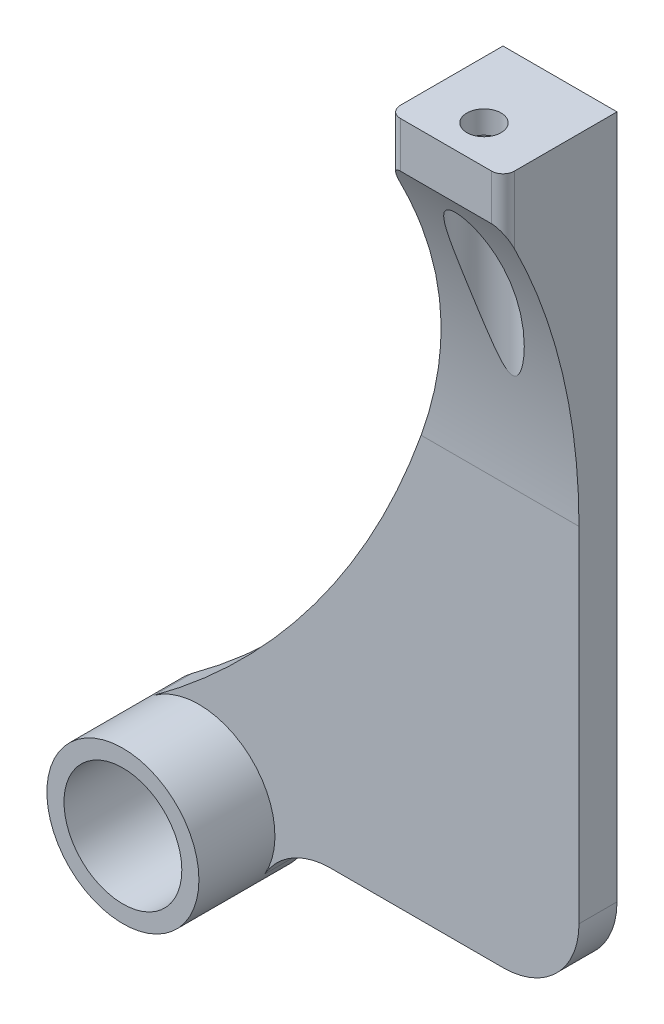
ISO-10303-21;
HEADER;
FILE_DESCRIPTION(('STEP AP214'),'2;1');
FILE_NAME('part.step','',(''),(''),'','','');
FILE_SCHEMA(('AUTOMOTIVE_DESIGN { 1 0 10303 214 1 1 1 1 }'));
ENDSEC;
DATA;
#1=APPLICATION_CONTEXT('core data for automotive mechanical design processes');
#2=APPLICATION_PROTOCOL_DEFINITION('international standard','automotive_design',2000,#1);
#3=PRODUCT_CONTEXT('',#1,'mechanical');
#4=PRODUCT('Part','Part','',(#3));
#5=PRODUCT_RELATED_PRODUCT_CATEGORY('part','',(#4));
#6=PRODUCT_DEFINITION_FORMATION('','',#4);
#7=PRODUCT_DEFINITION_CONTEXT('part definition',#1,'design');
#8=PRODUCT_DEFINITION('design','',#6,#7);
#9=PRODUCT_DEFINITION_SHAPE('','',#8);
#10=(LENGTH_UNIT() NAMED_UNIT(*) SI_UNIT(.MILLI.,.METRE.));
#11=(NAMED_UNIT(*) PLANE_ANGLE_UNIT() SI_UNIT($,.RADIAN.));
#12=(NAMED_UNIT(*) SI_UNIT($,.STERADIAN.) SOLID_ANGLE_UNIT());
#13=UNCERTAINTY_MEASURE_WITH_UNIT(LENGTH_MEASURE(1.E-05),#10,'distance_accuracy_value','');
#14=(GEOMETRIC_REPRESENTATION_CONTEXT(3) GLOBAL_UNCERTAINTY_ASSIGNED_CONTEXT((#13)) GLOBAL_UNIT_ASSIGNED_CONTEXT((#10,
#11,#12)) REPRESENTATION_CONTEXT('',''));
#15=CARTESIAN_POINT('',(0.,0.,0.));
#16=DIRECTION('',(0.,0.,1.));
#17=DIRECTION('',(1.,0.,0.));
#18=AXIS2_PLACEMENT_3D('',#15,#16,#17);
#19=CARTESIAN_POINT('',(-32.5,-50.,15.));
#20=DIRECTION('',(0.,1.,0.));
#21=DIRECTION('',(0.,0.,1.));
#22=AXIS2_PLACEMENT_3D('',#19,#20,#21);
#23=PLANE('',#22);
#24=DIRECTION('',(1.,0.,0.));
#25=VECTOR('',#24,1.);
#26=CARTESIAN_POINT('',(-25.1794919243112,-50.,5.));
#27=LINE('',#26,#25);
#28=CARTESIAN_POINT('',(-25.1794919243112,-50.,5.));
#29=VERTEX_POINT('',#28);
#30=CARTESIAN_POINT('',(-2.5,-50.,5.));
#31=VERTEX_POINT('',#30);
#32=EDGE_CURVE('E231',#29,#31,#27,.T.);
#33=ORIENTED_EDGE('',*,*,#32,.F.);
#34=DIRECTION('',(0.,0.,1.));
#35=VECTOR('',#34,1.);
#36=CARTESIAN_POINT('',(-25.1794919243112,-50.,0.));
#37=LINE('',#36,#35);
#38=CARTESIAN_POINT('',(-25.1794919243112,-50.,0.));
#39=VERTEX_POINT('',#38);
#40=EDGE_CURVE('E261',#29,#39,#37,.F.);
#41=ORIENTED_EDGE('',*,*,#40,.T.);
#42=DIRECTION('',(1.,0.,0.));
#43=VECTOR('',#42,1.);
#44=CARTESIAN_POINT('',(-32.5,-50.,0.));
#45=LINE('',#44,#43);
#46=CARTESIAN_POINT('',(-2.5,-50.,0.));
#47=VERTEX_POINT('',#46);
#48=EDGE_CURVE('E250',#39,#47,#45,.T.);
#49=ORIENTED_EDGE('',*,*,#48,.T.);
#50=DIRECTION('',(0.,0.,-1.));
#51=VECTOR('',#50,1.);
#52=CARTESIAN_POINT('',(-2.5,-50.,15.));
#53=LINE('',#52,#51);
#54=EDGE_CURVE('E263',#47,#31,#53,.F.);
#55=ORIENTED_EDGE('',*,*,#54,.T.);
#56=EDGE_LOOP('',(#33,#41,#49,#55));
#57=FACE_BOUND('',#56,.T.);
#58=ADVANCED_FACE('F39',(#57),#23,.F.);
#59=CARTESIAN_POINT('',(-42.5,-50.,15.));
#60=DIRECTION('',(0.,0.,1.));
#61=DIRECTION('',(1.,0.,0.));
#62=AXIS2_PLACEMENT_3D('',#59,#60,#61);
#63=PLANE('',#62);
#64=DIRECTION('',(1.,0.,0.));
#65=VECTOR('',#64,1.);
#66=CARTESIAN_POINT('',(-7.5,50.,15.));
#67=LINE('',#66,#65);
#68=CARTESIAN_POINT('',(-6.,50.,15.));
#69=VERTEX_POINT('',#68);
#70=CARTESIAN_POINT('',(6.,50.,15.));
#71=VERTEX_POINT('',#70);
#72=EDGE_CURVE('E237',#69,#71,#67,.T.);
#73=ORIENTED_EDGE('',*,*,#72,.F.);
#74=DIRECTION('',(0.,1.,0.));
#75=VECTOR('',#74,1.);
#76=CARTESIAN_POINT('',(-6.,-50.,15.));
#77=LINE('',#76,#75);
#78=CARTESIAN_POINT('',(-6.,44.,15.));
#79=VERTEX_POINT('',#78);
#80=EDGE_CURVE('E177',#69,#79,#77,.F.);
#81=ORIENTED_EDGE('',*,*,#80,.T.);
#82=DIRECTION('',(-1.,0.,0.));
#83=VECTOR('',#82,1.);
#84=CARTESIAN_POINT('',(-7.5,44.,15.));
#85=LINE('',#84,#83);
#86=CARTESIAN_POINT('',(6.,44.,15.));
#87=VERTEX_POINT('',#86);
#88=EDGE_CURVE('E145',#87,#79,#85,.T.);
#89=ORIENTED_EDGE('',*,*,#88,.F.);
#90=DIRECTION('',(0.,1.,0.));
#91=VECTOR('',#90,1.);
#92=CARTESIAN_POINT('',(6.,50.,15.));
#93=LINE('',#92,#91);
#94=EDGE_CURVE('E174',#87,#71,#93,.T.);
#95=ORIENTED_EDGE('',*,*,#94,.T.);
#96=EDGE_LOOP('',(#73,#81,#89,#95));
#97=FACE_BOUND('',#96,.T.);
#98=ADVANCED_FACE('F283',(#97),#63,.T.);
#99=CARTESIAN_POINT('',(-42.5,-50.,15.));
#100=DIRECTION('',(0.,0.,1.));
#101=DIRECTION('',(1.,0.,0.));
#102=AXIS2_PLACEMENT_3D('',#99,#100,#101);
#103=CIRCLE('',#102,7.75);
#104=CARTESIAN_POINT('',(-34.75,-50.,15.));
#105=VERTEX_POINT('',#104);
#106=EDGE_CURVE('E350',#105,#105,#103,.T.);
#107=ORIENTED_EDGE('',*,*,#106,.F.);
#108=EDGE_LOOP('',(#107));
#109=FACE_BOUND('',#108,.T.);
#110=CARTESIAN_POINT('',(-42.5,-50.,15.));
#111=DIRECTION('',(0.,0.,1.));
#112=DIRECTION('',(1.,0.,0.));
#113=AXIS2_PLACEMENT_3D('',#110,#111,#112);
#114=CIRCLE('',#113,10.);
#115=CARTESIAN_POINT('',(-32.5,-50.,15.));
#116=VERTEX_POINT('',#115);
#117=EDGE_CURVE('E240',#116,#116,#114,.T.);
#118=ORIENTED_EDGE('',*,*,#117,.T.);
#119=EDGE_LOOP('',(#118));
#120=FACE_BOUND('',#119,.T.);
#121=ADVANCED_FACE('F303',(#109,#120),#63,.T.);
#122=CARTESIAN_POINT('',(-2.5,-40.,15.));
#123=DIRECTION('',(0.,0.,-1.));
#124=DIRECTION('',(-1.,0.,0.));
#125=AXIS2_PLACEMENT_3D('',#122,#123,#124);
#126=CYLINDRICAL_SURFACE('',#125,10.);
#127=DIRECTION('',(0.,0.,-1.));
#128=VECTOR('',#127,1.);
#129=CARTESIAN_POINT('',(7.5,-40.,15.));
#130=LINE('',#129,#128);
#131=CARTESIAN_POINT('',(7.5,-40.,5.));
#132=VERTEX_POINT('',#131);
#133=CARTESIAN_POINT('',(7.5,-40.,0.));
#134=VERTEX_POINT('',#133);
#135=EDGE_CURVE('E256',#132,#134,#130,.T.);
#136=ORIENTED_EDGE('',*,*,#135,.F.);
#137=CARTESIAN_POINT('',(-2.5,-40.,5.));
#138=DIRECTION('',(0.,0.,1.));
#139=DIRECTION('',(1.,0.,0.));
#140=AXIS2_PLACEMENT_3D('',#137,#138,#139);
#141=CIRCLE('',#140,10.);
#142=EDGE_CURVE('E225',#31,#132,#141,.T.);
#143=ORIENTED_EDGE('',*,*,#142,.F.);
#144=ORIENTED_EDGE('',*,*,#54,.F.);
#145=CARTESIAN_POINT('',(-2.5,-40.,0.));
#146=DIRECTION('',(0.,0.,1.));
#147=DIRECTION('',(1.,0.,0.));
#148=AXIS2_PLACEMENT_3D('',#145,#146,#147);
#149=CIRCLE('',#148,10.);
#150=EDGE_CURVE('E259',#134,#47,#149,.F.);
#151=ORIENTED_EDGE('',*,*,#150,.F.);
#152=EDGE_LOOP('',(#136,#143,#144,#151));
#153=FACE_BOUND('',#152,.T.);
#154=ADVANCED_FACE('F272',(#153),#126,.T.);
#155=CARTESIAN_POINT('',(-25.1794919243112,-60.,15.));
#156=DIRECTION('',(0.,0.,-1.));
#157=DIRECTION('',(-1.,0.,0.));
#158=AXIS2_PLACEMENT_3D('',#155,#156,#157);
#159=CYLINDRICAL_SURFACE('',#158,10.);
#160=CARTESIAN_POINT('',(-25.1794919243112,-60.,5.));
#161=DIRECTION('',(0.,0.,-1.));
#162=DIRECTION('',(1.,0.,0.));
#163=AXIS2_PLACEMENT_3D('',#160,#161,#162);
#164=CIRCLE('',#163,10.);
#165=CARTESIAN_POINT('',(-33.8397459621556,-55.,5.));
#166=VERTEX_POINT('',#165);
#167=EDGE_CURVE('E154',#166,#29,#164,.T.);
#168=ORIENTED_EDGE('',*,*,#167,.F.);
#169=DIRECTION('',(0.,0.,-1.));
#170=VECTOR('',#169,1.);
#171=CARTESIAN_POINT('',(-33.8397459621556,-55.,15.));
#172=LINE('',#171,#170);
#173=CARTESIAN_POINT('',(-33.8397459621556,-55.,0.));
#174=VERTEX_POINT('',#173);
#175=EDGE_CURVE('E153',#174,#166,#172,.F.);
#176=ORIENTED_EDGE('',*,*,#175,.F.);
#177=CARTESIAN_POINT('',(-25.1794919243112,-60.,0.));
#178=DIRECTION('',(0.,0.,1.));
#179=DIRECTION('',(1.,0.,0.));
#180=AXIS2_PLACEMENT_3D('',#177,#178,#179);
#181=CIRCLE('',#180,10.);
#182=EDGE_CURVE('E161',#39,#174,#181,.T.);
#183=ORIENTED_EDGE('',*,*,#182,.F.);
#184=ORIENTED_EDGE('',*,*,#40,.F.);
#185=EDGE_LOOP('',(#168,#176,#183,#184));
#186=FACE_BOUND('',#185,.T.);
#187=ADVANCED_FACE('F195',(#186),#159,.F.);
#188=CARTESIAN_POINT('',(-107.5,38.7411967464943,15.));
#189=DIRECTION('',(0.,0.,-1.));
#190=DIRECTION('',(-1.,0.,0.));
#191=AXIS2_PLACEMENT_3D('',#188,#189,#190);
#192=CYLINDRICAL_SURFACE('',#191,100.);
#193=CARTESIAN_POINT('',(-107.5,38.7411967464943,5.));
#194=DIRECTION('',(0.,0.,-1.));
#195=DIRECTION('',(1.,0.,0.));
#196=AXIS2_PLACEMENT_3D('',#193,#194,#195);
#197=CIRCLE('',#196,100.);
#198=CARTESIAN_POINT('',(-13.2678922193868,5.27016653792584,5.));
#199=VERTEX_POINT('',#198);
#200=CARTESIAN_POINT('',(-48.409090909091,-41.9326184775915,5.));
#201=VERTEX_POINT('',#200);
#202=EDGE_CURVE('E134',#199,#201,#197,.T.);
#203=ORIENTED_EDGE('',*,*,#202,.F.);
#204=CARTESIAN_POINT('',(-13.2678922193868,5.27016653792584,5.));
#205=CARTESIAN_POINT('',(-12.9601483993061,6.13650162935288,4.99998081129785));
#206=CARTESIAN_POINT('',(-12.6643852790211,7.00711687347346,5.01407204240441));
#207=CARTESIAN_POINT('',(-12.0972075129909,8.75535744566515,5.0711717880983));
#208=CARTESIAN_POINT('',(-11.8257943491233,9.6329831968434,5.11418206127511));
#209=CARTESIAN_POINT('',(-11.3076411514151,11.3939284760898,5.22983881612321));
#210=CARTESIAN_POINT('',(-11.0609106785094,12.2772500705213,5.30249672699747));
#211=CARTESIAN_POINT('',(-10.5925178092302,14.0475116901373,5.47799501129461));
#212=CARTESIAN_POINT('',(-10.3708546831186,14.9344516092093,5.58083450578482));
#213=CARTESIAN_POINT('',(-9.95749111681641,16.6900365864316,5.81444042111758));
#214=CARTESIAN_POINT('',(-9.76522467771554,17.5586398329573,5.94451979925321));
#215=CARTESIAN_POINT('',(-9.40479890683767,19.2959265322389,6.23418529288521));
#216=CARTESIAN_POINT('',(-9.23663948002106,20.164609984665,6.39377129204886));
#217=CARTESIAN_POINT('',(-8.92438957078949,21.8999982022366,6.74252965994711));
#218=CARTESIAN_POINT('',(-8.78028960873859,22.7667036133539,6.93169031885455));
#219=CARTESIAN_POINT('',(-8.51586294264522,24.4966775859483,7.33964264608898));
#220=CARTESIAN_POINT('',(-8.39553453512546,25.3599463893467,7.55843218930531));
#221=CARTESIAN_POINT('',(-8.15318384294389,27.2803677110144,8.07954536859807));
#222=CARTESIAN_POINT('',(-8.03719485756907,28.3362282546396,8.38948933262638));
#223=CARTESIAN_POINT('',(-7.83981116216768,30.4369891928573,9.05367252119334));
#224=CARTESIAN_POINT('',(-7.75841177302028,31.4818910512266,9.40790574608929));
#225=CARTESIAN_POINT('',(-7.62807670595758,33.5728625070728,10.1654403561484));
#226=CARTESIAN_POINT('',(-7.57962234847821,34.6187347646058,10.5693714756851));
#227=CARTESIAN_POINT('',(-7.53159213303704,36.1746967807895,11.208234839552));
#228=CARTESIAN_POINT('',(-7.51969065186097,36.6912539854283,11.4267041274613));
#229=CARTESIAN_POINT('',(-7.5038942343988,37.7197557383955,11.8745001565184));
#230=CARTESIAN_POINT('',(-7.49999918064137,38.2317003542908,12.1038267383161));
#231=CARTESIAN_POINT('',(-7.49999999999995,38.7411967464943,12.338523709072));
#232=B_SPLINE_CURVE_WITH_KNOTS('',3,(#204,#205,#206,#207,#208,#209,#210,#211,#212,#213,#214,
#215,#216,#217,#218,#219,#220,#221,#222,#223,#224,#225,#226,#227,#228,#229,#230,#231),
.UNSPECIFIED.,.F.,.F.,(4,2,2,2,2,2,2,2,2,2,2,2,2,4),(0.,2.75795055143389,5.51606883116076,
8.27525137511027,11.0343535755257,13.7308149029786,16.427265599597,19.1226513513999,
21.8178438808677,25.1358129141561,28.4533329649211,31.818335888587,33.5011293866039,
35.1838981942828),.UNSPECIFIED.);
#233=CARTESIAN_POINT('',(-7.5,38.7411967464943,12.338523709072));
#234=VERTEX_POINT('',#233);
#235=EDGE_CURVE('E182',#199,#234,#232,.T.);
#236=ORIENTED_EDGE('',*,*,#235,.T.);
#237=DIRECTION('',(0.,0.,-1.));
#238=VECTOR('',#237,1.);
#239=CARTESIAN_POINT('',(-7.5,38.7411967464943,15.));
#240=LINE('',#239,#238);
#241=CARTESIAN_POINT('',(-7.5,38.7411967464943,0.));
#242=VERTEX_POINT('',#241);
#243=EDGE_CURVE('E160',#242,#234,#240,.F.);
#244=ORIENTED_EDGE('',*,*,#243,.F.);
#245=CARTESIAN_POINT('',(-107.5,38.7411967464943,0.));
#246=DIRECTION('',(0.,0.,1.));
#247=DIRECTION('',(1.,0.,0.));
#248=AXIS2_PLACEMENT_3D('',#245,#246,#247);
#249=CIRCLE('',#248,100.);
#250=CARTESIAN_POINT('',(-48.4090909090909,-41.9326184775914,0.));
#251=VERTEX_POINT('',#250);
#252=EDGE_CURVE('E158',#251,#242,#249,.T.);
#253=ORIENTED_EDGE('',*,*,#252,.F.);
#254=DIRECTION('',(0.,0.,-1.));
#255=VECTOR('',#254,1.);
#256=CARTESIAN_POINT('',(-48.4090909090909,-41.9326184775914,15.));
#257=LINE('',#256,#255);
#258=EDGE_CURVE('E150',#201,#251,#257,.T.);
#259=ORIENTED_EDGE('',*,*,#258,.F.);
#260=EDGE_LOOP('',(#203,#236,#244,#253,#259));
#261=FACE_BOUND('',#260,.T.);
#262=ADVANCED_FACE('F156',(#261),#192,.F.);
#263=CARTESIAN_POINT('',(-42.5,-50.,15.));
#264=DIRECTION('',(0.,0.,-1.));
#265=DIRECTION('',(-1.,0.,0.));
#266=AXIS2_PLACEMENT_3D('',#263,#264,#265);
#267=CYLINDRICAL_SURFACE('',#266,10.);
#268=ORIENTED_EDGE('',*,*,#117,.F.);
#269=EDGE_LOOP('',(#268));
#270=FACE_BOUND('',#269,.T.);
#271=ORIENTED_EDGE('',*,*,#175,.T.);
#272=CARTESIAN_POINT('',(-42.5,-50.,5.));
#273=DIRECTION('',(0.,0.,-1.));
#274=DIRECTION('',(1.,0.,0.));
#275=AXIS2_PLACEMENT_3D('',#272,#273,#274);
#276=CIRCLE('',#275,10.);
#277=EDGE_CURVE('E138',#201,#166,#276,.T.);
#278=ORIENTED_EDGE('',*,*,#277,.F.);
#279=ORIENTED_EDGE('',*,*,#258,.T.);
#280=CARTESIAN_POINT('',(-42.5,-50.,0.));
#281=DIRECTION('',(0.,0.,1.));
#282=DIRECTION('',(1.,0.,0.));
#283=AXIS2_PLACEMENT_3D('',#280,#281,#282);
#284=CIRCLE('',#283,10.);
#285=EDGE_CURVE('E241',#251,#174,#284,.T.);
#286=ORIENTED_EDGE('',*,*,#285,.T.);
#287=EDGE_LOOP('',(#271,#278,#279,#286));
#288=FACE_BOUND('',#287,.T.);
#289=ADVANCED_FACE('F149',(#270,#288),#267,.T.);
#290=CARTESIAN_POINT('',(7.5,-50.,15.));
#291=DIRECTION('',(-1.,0.,0.));
#292=DIRECTION('',(0.,0.,1.));
#293=AXIS2_PLACEMENT_3D('',#290,#291,#292);
#294=PLANE('',#293);
#295=DIRECTION('',(0.,0.,-1.));
#296=VECTOR('',#295,1.);
#297=CARTESIAN_POINT('',(7.5,50.,15.));
#298=LINE('',#297,#296);
#299=CARTESIAN_POINT('',(7.5,50.,13.5));
#300=VERTEX_POINT('',#299);
#301=CARTESIAN_POINT('',(7.5,50.,0.));
#302=VERTEX_POINT('',#301);
#303=EDGE_CURVE('E254',#300,#302,#298,.T.);
#304=ORIENTED_EDGE('',*,*,#303,.F.);
#305=DIRECTION('',(0.,1.,0.));
#306=VECTOR('',#305,1.);
#307=CARTESIAN_POINT('',(7.5,44.,13.5));
#308=LINE('',#307,#306);
#309=CARTESIAN_POINT('',(7.5,41.1554002699221,13.5));
#310=VERTEX_POINT('',#309);
#311=EDGE_CURVE('E59',#300,#310,#308,.F.);
#312=ORIENTED_EDGE('',*,*,#311,.T.);
#313=CARTESIAN_POINT('',(7.5,5.27016653792584,85.));
#314=DIRECTION('',(-1.,0.,0.));
#315=DIRECTION('',(0.,0.,1.));
#316=AXIS2_PLACEMENT_3D('',#313,#314,#315);
#317=CIRCLE('',#316,80.);
#318=CARTESIAN_POINT('',(7.5,5.27016653792583,5.));
#319=VERTEX_POINT('',#318);
#320=EDGE_CURVE('E11',#310,#319,#317,.T.);
#321=ORIENTED_EDGE('',*,*,#320,.T.);
#322=DIRECTION('',(0.,1.,0.));
#323=VECTOR('',#322,1.);
#324=CARTESIAN_POINT('',(7.5,-40.,5.));
#325=LINE('',#324,#323);
#326=EDGE_CURVE('E222',#132,#319,#325,.T.);
#327=ORIENTED_EDGE('',*,*,#326,.F.);
#328=ORIENTED_EDGE('',*,*,#135,.T.);
#329=DIRECTION('',(0.,1.,0.));
#330=VECTOR('',#329,1.);
#331=CARTESIAN_POINT('',(7.5,-50.,0.));
#332=LINE('',#331,#330);
#333=EDGE_CURVE('E247',#134,#302,#332,.T.);
#334=ORIENTED_EDGE('',*,*,#333,.T.);
#335=EDGE_LOOP('',(#304,#312,#321,#327,#328,#334));
#336=FACE_BOUND('',#335,.T.);
#337=ADVANCED_FACE('F221',(#336),#294,.F.);
#338=CARTESIAN_POINT('',(-7.5,50.,15.));
#339=DIRECTION('',(0.,1.,0.));
#340=DIRECTION('',(0.,0.,1.));
#341=AXIS2_PLACEMENT_3D('',#338,#339,#340);
#342=PLANE('',#341);
#343=CARTESIAN_POINT('',(0.,50.,10.));
#344=DIRECTION('',(0.,-1.,0.));
#345=DIRECTION('',(0.,0.,-1.));
#346=AXIS2_PLACEMENT_3D('',#343,#344,#345);
#347=CIRCLE('',#346,2.25);
#348=CARTESIAN_POINT('',(0.,50.,7.75));
#349=VERTEX_POINT('',#348);
#350=EDGE_CURVE('E353',#349,#349,#347,.T.);
#351=ORIENTED_EDGE('',*,*,#350,.T.);
#352=EDGE_LOOP('',(#351));
#353=FACE_BOUND('',#352,.T.);
#354=DIRECTION('',(0.,0.,-1.));
#355=VECTOR('',#354,1.);
#356=CARTESIAN_POINT('',(-7.5,50.,15.));
#357=LINE('',#356,#355);
#358=CARTESIAN_POINT('',(-7.5,50.,13.5));
#359=VERTEX_POINT('',#358);
#360=CARTESIAN_POINT('',(-7.5,50.,0.));
#361=VERTEX_POINT('',#360);
#362=EDGE_CURVE('E243',#359,#361,#357,.T.);
#363=ORIENTED_EDGE('',*,*,#362,.F.);
#364=CARTESIAN_POINT('',(-6.,50.,13.5));
#365=DIRECTION('',(0.,1.,0.));
#366=DIRECTION('',(0.,0.,1.));
#367=AXIS2_PLACEMENT_3D('',#364,#365,#366);
#368=CIRCLE('',#367,1.5);
#369=EDGE_CURVE('E172',#359,#69,#368,.T.);
#370=ORIENTED_EDGE('',*,*,#369,.T.);
#371=ORIENTED_EDGE('',*,*,#72,.T.);
#372=CARTESIAN_POINT('',(6.,50.,13.5));
#373=DIRECTION('',(0.,1.,0.));
#374=DIRECTION('',(0.,0.,1.));
#375=AXIS2_PLACEMENT_3D('',#372,#373,#374);
#376=CIRCLE('',#375,1.5);
#377=EDGE_CURVE('E170',#71,#300,#376,.T.);
#378=ORIENTED_EDGE('',*,*,#377,.T.);
#379=ORIENTED_EDGE('',*,*,#303,.T.);
#380=DIRECTION('',(1.,0.,0.));
#381=VECTOR('',#380,1.);
#382=CARTESIAN_POINT('',(-7.5,50.,0.));
#383=LINE('',#382,#381);
#384=EDGE_CURVE('E229',#361,#302,#383,.T.);
#385=ORIENTED_EDGE('',*,*,#384,.F.);
#386=EDGE_LOOP('',(#363,#370,#371,#378,#379,#385));
#387=FACE_BOUND('',#386,.T.);
#388=ADVANCED_FACE('F280',(#353,#387),#342,.T.);
#389=CARTESIAN_POINT('',(-7.5,-40.,15.));
#390=DIRECTION('',(-1.,0.,0.));
#391=DIRECTION('',(0.,0.,1.));
#392=AXIS2_PLACEMENT_3D('',#389,#390,#391);
#393=PLANE('',#392);
#394=ORIENTED_EDGE('',*,*,#243,.T.);
#395=CARTESIAN_POINT('',(-7.5,5.27016653792584,85.));
#396=DIRECTION('',(-1.,0.,0.));
#397=DIRECTION('',(0.,0.,1.));
#398=AXIS2_PLACEMENT_3D('',#395,#396,#397);
#399=CIRCLE('',#398,80.);
#400=CARTESIAN_POINT('',(-7.5,41.1554002699221,13.5));
#401=VERTEX_POINT('',#400);
#402=EDGE_CURVE('E189',#234,#401,#399,.F.);
#403=ORIENTED_EDGE('',*,*,#402,.T.);
#404=DIRECTION('',(0.,1.,0.));
#405=VECTOR('',#404,1.);
#406=CARTESIAN_POINT('',(-7.5,-40.,13.5));
#407=LINE('',#406,#405);
#408=EDGE_CURVE('E67',#401,#359,#407,.T.);
#409=ORIENTED_EDGE('',*,*,#408,.T.);
#410=ORIENTED_EDGE('',*,*,#362,.T.);
#411=DIRECTION('',(0.,1.,0.));
#412=VECTOR('',#411,1.);
#413=CARTESIAN_POINT('',(-7.5,-40.,0.));
#414=LINE('',#413,#412);
#415=EDGE_CURVE('E226',#242,#361,#414,.T.);
#416=ORIENTED_EDGE('',*,*,#415,.F.);
#417=EDGE_LOOP('',(#394,#403,#409,#410,#416));
#418=FACE_BOUND('',#417,.T.);
#419=ADVANCED_FACE('F288',(#418),#393,.T.);
#420=CARTESIAN_POINT('',(-42.5,-50.,0.));
#421=DIRECTION('',(0.,0.,1.));
#422=DIRECTION('',(1.,0.,0.));
#423=AXIS2_PLACEMENT_3D('',#420,#421,#422);
#424=PLANE('',#423);
#425=ORIENTED_EDGE('',*,*,#333,.F.);
#426=ORIENTED_EDGE('',*,*,#150,.T.);
#427=ORIENTED_EDGE('',*,*,#48,.F.);
#428=ORIENTED_EDGE('',*,*,#182,.T.);
#429=ORIENTED_EDGE('',*,*,#285,.F.);
#430=ORIENTED_EDGE('',*,*,#252,.T.);
#431=ORIENTED_EDGE('',*,*,#415,.T.);
#432=ORIENTED_EDGE('',*,*,#384,.T.);
#433=EDGE_LOOP('',(#425,#426,#427,#428,#429,#430,#431,#432));
#434=FACE_BOUND('',#433,.T.);
#435=ADVANCED_FACE('F276',(#434),#424,.F.);
#436=CARTESIAN_POINT('',(-107.5,38.7411967464943,5.));
#437=DIRECTION('',(0.,0.,1.));
#438=DIRECTION('',(1.,0.,0.));
#439=AXIS2_PLACEMENT_3D('',#436,#437,#438);
#440=PLANE('',#439);
#441=ORIENTED_EDGE('',*,*,#326,.T.);
#442=DIRECTION('',(-1.,0.,0.));
#443=VECTOR('',#442,1.);
#444=CARTESIAN_POINT('',(-7.5,5.27016653792584,5.));
#445=LINE('',#444,#443);
#446=EDGE_CURVE('E141',#319,#199,#445,.T.);
#447=ORIENTED_EDGE('',*,*,#446,.T.);
#448=ORIENTED_EDGE('',*,*,#202,.T.);
#449=ORIENTED_EDGE('',*,*,#277,.T.);
#450=ORIENTED_EDGE('',*,*,#167,.T.);
#451=ORIENTED_EDGE('',*,*,#32,.T.);
#452=ORIENTED_EDGE('',*,*,#142,.T.);
#453=EDGE_LOOP('',(#441,#447,#448,#449,#450,#451,#452));
#454=FACE_BOUND('',#453,.T.);
#455=ADVANCED_FACE('F137',(#454),#440,.T.);
#456=CARTESIAN_POINT('',(0.,47.,10.));
#457=DIRECTION('',(0.,-1.,0.));
#458=DIRECTION('',(0.,0.,-1.));
#459=AXIS2_PLACEMENT_3D('',#456,#457,#458);
#460=CYLINDRICAL_SURFACE('',#459,3.75);
#461=CARTESIAN_POINT('',(0.,47.,10.));
#462=DIRECTION('',(0.,-1.,0.));
#463=DIRECTION('',(0.,0.,-1.));
#464=AXIS2_PLACEMENT_3D('',#461,#462,#463);
#465=CIRCLE('',#464,3.75);
#466=CARTESIAN_POINT('',(0.,47.,6.25));
#467=VERTEX_POINT('',#466);
#468=EDGE_CURVE('E236',#467,#467,#465,.T.);
#469=ORIENTED_EDGE('',*,*,#468,.F.);
#470=EDGE_LOOP('',(#469));
#471=FACE_BOUND('',#470,.T.);
#472=CARTESIAN_POINT('',(0.,41.6492470650639,13.75));
#473=CARTESIAN_POINT('',(-0.103290115809549,41.6492353136118,13.7499937866904));
#474=CARTESIAN_POINT('',(-0.206641793749805,41.6408011457425,13.7456857137423));
#475=CARTESIAN_POINT('',(-0.410099021051103,41.6079226619879,13.7289133322065));
#476=CARTESIAN_POINT('',(-0.51020015918618,41.58345747169,13.7164383893437));
#477=CARTESIAN_POINT('',(-0.726449234755903,41.5136938198538,13.6809382630349));
#478=CARTESIAN_POINT('',(-0.84119023568142,41.4649635899432,13.6561794465864));
#479=CARTESIAN_POINT('',(-1.06032735450049,41.3515713409291,13.59876583941));
#480=CARTESIAN_POINT('',(-1.16470434655804,41.2868806073106,13.5660968194406));
#481=CARTESIAN_POINT('',(-1.3410523837497,41.1613727201537,13.5029712564811));
#482=CARTESIAN_POINT('',(-1.41509446273928,41.1028460739009,13.4736149177559));
#483=CARTESIAN_POINT('',(-1.55719846543446,40.980141320759,13.4122746212459));
#484=CARTESIAN_POINT('',(-1.62525679710204,40.91595986495,13.3802891071596));
#485=CARTESIAN_POINT('',(-1.82133247463236,40.7165602526635,13.2812780780344));
#486=CARTESIAN_POINT('',(-1.94104330203957,40.5746429133039,13.2112768335098));
#487=CARTESIAN_POINT('',(-2.15726630357029,40.2857879753855,13.0699565466452));
#488=CARTESIAN_POINT('',(-2.2545454133809,40.1393164437266,12.9988184055641));
#489=CARTESIAN_POINT('',(-2.43511342605201,39.8389735016779,12.8541381083058));
#490=CARTESIAN_POINT('',(-2.51838915853908,39.6850952981951,12.7805937658465));
#491=CARTESIAN_POINT('',(-2.6731593979921,39.3718496072688,12.632152634195));
#492=CARTESIAN_POINT('',(-2.74463368564793,39.2124732531052,12.5572537629055));
#493=CARTESIAN_POINT('',(-2.87733579943247,38.8898454624713,12.4069641127683));
#494=CARTESIAN_POINT('',(-2.93856684662525,38.726595262669,12.3315734963309));
#495=CARTESIAN_POINT('',(-3.05851714567722,38.378628426663,12.1723243265784));
#496=CARTESIAN_POINT('',(-3.11618807785877,38.1935543520959,12.0884625021724));
#497=CARTESIAN_POINT('',(-3.22202764215178,37.8204972422381,11.9211536248703));
#498=CARTESIAN_POINT('',(-3.27019403235079,37.6325135318782,11.8377066743479));
#499=CARTESIAN_POINT('',(-3.35819255201935,37.2541154218064,11.6714942738636));
#500=CARTESIAN_POINT('',(-3.39801732615149,37.0636990326818,11.5887294866586));
#501=CARTESIAN_POINT('',(-3.47019764584339,36.6810262882391,11.4241799205326));
#502=CARTESIAN_POINT('',(-3.50255229815615,36.4887697157389,11.3423952599188));
#503=CARTESIAN_POINT('',(-3.58976515143273,35.9084538158204,11.0982289263024));
#504=CARTESIAN_POINT('',(-3.6344892830812,35.5181156196498,10.9375919926184));
#505=CARTESIAN_POINT('',(-3.70156233637096,34.7335826021423,10.6220062553514));
#506=CARTESIAN_POINT('',(-3.72392183481847,34.3393896929508,10.4670547963946));
#507=CARTESIAN_POINT('',(-3.75066759141277,33.5134322933017,10.1499475580254));
#508=CARTESIAN_POINT('',(-3.75330915883213,33.0813995383819,9.98834851420286));
#509=CARTESIAN_POINT('',(-3.73902914466409,32.214838646003,9.6727315223477));
#510=CARTESIAN_POINT('',(-3.72210340448494,31.7803099976299,9.51871519310474));
#511=CARTESIAN_POINT('',(-3.67079416166239,30.9090136164144,9.2183257381548));
#512=CARTESIAN_POINT('',(-3.63638736462935,30.4722436676798,9.07196309914719));
#513=CARTESIAN_POINT('',(-3.55159250816836,29.5977028762075,8.78725541966323));
#514=CARTESIAN_POINT('',(-3.50120590601364,29.1599321283501,8.6489096494512));
#515=CARTESIAN_POINT('',(-3.38555796472023,28.2855983146318,8.38082375235309));
#516=CARTESIAN_POINT('',(-3.3203546220766,27.8490370854877,8.2510525533116));
#517=CARTESIAN_POINT('',(-3.17521380893426,26.9760427424359,7.9996020656188));
#518=CARTESIAN_POINT('',(-3.09527649417402,26.5396096272227,7.87792269145518));
#519=CARTESIAN_POINT('',(-2.92025290593977,25.6681062656315,7.64285796280534));
#520=CARTESIAN_POINT('',(-2.82518520565652,25.2330350066763,7.52946268506508));
#521=CARTESIAN_POINT('',(-2.66982161745145,24.5819857004405,7.36557627402754));
#522=CARTESIAN_POINT('',(-2.61591242137034,24.3652491832356,7.31198663871114));
#523=CARTESIAN_POINT('',(-2.50339806940414,23.9324909459629,7.20689485293088));
#524=CARTESIAN_POINT('',(-2.44479311033684,23.7164691963311,7.15539261511211));
#525=CARTESIAN_POINT('',(-2.33957365055403,23.3463392641416,7.06876619640985));
#526=CARTESIAN_POINT('',(-2.29425024302834,23.1919842448091,7.0331262314461));
#527=CARTESIAN_POINT('',(-2.20052358247651,22.8839390003612,6.96295769168805));
#528=CARTESIAN_POINT('',(-2.15212005845825,22.7302488350144,6.92842921508731));
#529=CARTESIAN_POINT('',(-2.05162600050108,22.4232786284399,6.86040993358965));
#530=CARTESIAN_POINT('',(-1.99952425619923,22.2700014353874,6.82692276841045));
#531=CARTESIAN_POINT('',(-1.89114357819857,21.9647173804016,6.76115834555362));
#532=CARTESIAN_POINT('',(-1.83486593230684,21.8127101427832,6.7288807194494));
#533=CARTESIAN_POINT('',(-1.71674963191086,21.5092768690417,6.66536215029507));
#534=CARTESIAN_POINT('',(-1.65487265199787,21.3578636113734,6.63413072827225));
#535=CARTESIAN_POINT('',(-1.52438129699177,21.0574277095152,6.57305362979143));
#536=CARTESIAN_POINT('',(-1.45575839281124,20.9084083761737,6.54320977972793));
#537=CARTESIAN_POINT('',(-1.30973952678582,20.6148795265858,6.48527525333844));
#538=CARTESIAN_POINT('',(-1.23237350829345,20.4703566572603,6.45717907524903));
#539=CARTESIAN_POINT('',(-1.10656575407957,20.2592520495368,6.41671636394087));
#540=CARTESIAN_POINT('',(-1.06305600470879,20.1899028368314,6.40352249660716));
#541=CARTESIAN_POINT('',(-0.971892735473961,20.0538718138132,6.37782225335531));
#542=CARTESIAN_POINT('',(-0.924241700881942,19.9871884382829,6.36531547235824));
#543=CARTESIAN_POINT('',(-0.815027359158199,19.8466682538809,6.33913596492328));
#544=CARTESIAN_POINT('',(-0.752478238330839,19.7735569200947,6.32562933874871));
#545=CARTESIAN_POINT('',(-0.617503532856728,19.6368697691867,6.30055550817817));
#546=CARTESIAN_POINT('',(-0.54514047057337,19.5732385477425,6.28897698448459));
#547=CARTESIAN_POINT('',(-0.429904105670458,19.493516883043,6.27454676532722));
#548=CARTESIAN_POINT('',(-0.392195032085164,19.4703039017346,6.27035792017214));
#549=CARTESIAN_POINT('',(-0.313840412729181,19.4291616226955,6.26294843706788));
#550=CARTESIAN_POINT('',(-0.273195232363438,19.4112316688861,6.25972767889476));
#551=CARTESIAN_POINT('',(-0.188785375665962,19.382172081247,6.25451424219145));
#552=CARTESIAN_POINT('',(-0.144986824088067,19.3711345553883,6.25253819461836));
#553=CARTESIAN_POINT('',(-0.0560553195149276,19.357829587529,6.25015681596605));
#554=CARTESIAN_POINT('',(-0.0109249691011292,19.3555460517886,6.2497486025056));
#555=CARTESIAN_POINT('',(0.0730251640136744,19.359781798016,6.25050641006353));
#556=CARTESIAN_POINT('',(0.111907829285128,19.3652032604492,6.25147610206591));
#557=CARTESIAN_POINT('',(0.188243124218459,19.3822676415343,6.2545323437349));
#558=CARTESIAN_POINT('',(0.225693963511098,19.3939180928294,6.25662024564485));
#559=CARTESIAN_POINT('',(0.314068016986858,19.4283993428794,6.2628114464408));
#560=CARTESIAN_POINT('',(0.363908566297366,19.4538803979723,6.26739472219681));
#561=CARTESIAN_POINT('',(0.45903380804703,19.5120209445221,6.27789093519152));
#562=CARTESIAN_POINT('',(0.504305928665959,19.5446994972313,6.28380740412679));
#563=CARTESIAN_POINT('',(0.589156817836399,19.6135870838897,6.29633127398084));
#564=CARTESIAN_POINT('',(0.628882813652513,19.6496243770824,6.30290569851962));
#565=CARTESIAN_POINT('',(0.705138511314446,19.724853853123,6.31668868108662));
#566=CARTESIAN_POINT('',(0.741664917315817,19.7640492110999,6.32389787801016));
#567=CARTESIAN_POINT('',(0.812112356269202,19.8447928112685,6.33881541714196));
#568=CARTESIAN_POINT('',(0.84602608373041,19.8863471241089,6.3465250552602));
#569=CARTESIAN_POINT('',(0.911560866416071,19.9711090089391,6.36232358632297));
#570=CARTESIAN_POINT('',(0.943183019763427,20.0143157737044,6.37041229451575));
#571=CARTESIAN_POINT('',(1.02982147283571,20.138169203108,6.39370821557604));
#572=CARTESIAN_POINT('',(1.08261657654592,20.2202978995608,6.40928313398556));
#573=CARTESIAN_POINT('',(1.18342374787362,20.3873097870742,6.4412370784334));
#574=CARTESIAN_POINT('',(1.2314326306706,20.4721947630628,6.45761662920871));
#575=CARTESIAN_POINT('',(1.32375792439584,20.6440339186829,6.49107134849782));
#576=CARTESIAN_POINT('',(1.36806660696007,20.730991964428,6.50814786724809));
#577=CARTESIAN_POINT('',(1.45360365867763,20.9063020127363,6.54288264678275));
#578=CARTESIAN_POINT('',(1.49483151585033,20.9946542440478,6.56054100355921));
#579=CARTESIAN_POINT('',(1.61509965024221,21.2621524391442,6.61448126303812));
#580=CARTESIAN_POINT('',(1.69027537359317,21.442874736423,6.65156019686588));
#581=CARTESIAN_POINT('',(1.83299284490698,21.8065920722252,6.72751983911582));
#582=CARTESIAN_POINT('',(1.90054463176157,21.9895837614018,6.7663980808125));
#583=CARTESIAN_POINT('',(2.02940225422569,22.3563492130386,6.84568225650243));
#584=CARTESIAN_POINT('',(2.09073757063929,22.5401145185231,6.88607960076773));
#585=CARTESIAN_POINT('',(2.20855882353158,22.9088318215419,6.96851150106851));
#586=CARTESIAN_POINT('',(2.26504440607793,23.0937839046301,7.0105461762711));
#587=CARTESIAN_POINT('',(2.42833571933188,23.6500335587524,7.13906442999603));
#588=CARTESIAN_POINT('',(2.5289361550281,24.0226077407415,7.22793702625846));
#589=CARTESIAN_POINT('',(2.71700548975171,24.7702549625498,7.41201670046059));
#590=CARTESIAN_POINT('',(2.80444874115761,25.1453314317843,7.50723564145341));
#591=CARTESIAN_POINT('',(2.96749721064333,25.8963798254868,7.70375194030569));
#592=CARTESIAN_POINT('',(3.04310465656418,26.2723515678799,7.80504814927017));
#593=CARTESIAN_POINT('',(3.18316482290469,27.0244513831496,8.01361613251762));
#594=CARTESIAN_POINT('',(3.24762439173235,27.4005792167376,8.12088418422349));
#595=CARTESIAN_POINT('',(3.36559807803682,28.1528197260827,8.34142044015436));
#596=CARTESIAN_POINT('',(3.41911149668066,28.5289323993402,8.45468902688952));
#597=CARTESIAN_POINT('',(3.51488450685513,29.2803092506674,8.68704236318719));
#598=CARTESIAN_POINT('',(3.55715720039291,29.655573906592,8.80612014825899));
#599=CARTESIAN_POINT('',(3.62994298138561,30.4053056404055,9.05014689767085));
#600=CARTESIAN_POINT('',(3.66045696370434,30.7797727768295,9.17509541442305));
#601=CARTESIAN_POINT('',(3.71473623152893,31.618797226514,9.46198789740497));
#602=CARTESIAN_POINT('',(3.73503831732906,32.0830429643671,9.62551999877693));
#603=CARTESIAN_POINT('',(3.75357548931575,33.0090554330539,9.96136587792969));
#604=CARTESIAN_POINT('',(3.75180278926286,33.4708212317042,10.1336827329329));
#605=CARTESIAN_POINT('',(3.72986859622429,34.1593365802755,10.3978824244488));
#606=CARTESIAN_POINT('',(3.71939346638991,34.3876014748141,10.48667973461));
#607=CARTESIAN_POINT('',(3.69146555673356,34.8429313542278,10.666215984071));
#608=CARTESIAN_POINT('',(3.67401327595575,35.0699964237444,10.7569547840657));
#609=CARTESIAN_POINT('',(3.63143881089534,35.5225572566427,10.940210447067));
#610=CARTESIAN_POINT('',(3.60632049583894,35.7480537531305,11.0327263910845));
#611=CARTESIAN_POINT('',(3.54755221179732,36.1972298022235,11.2194071044727));
#612=CARTESIAN_POINT('',(3.51390333574569,36.4209095838001,11.3135716611857));
#613=CARTESIAN_POINT('',(3.44742774170931,36.8056691901415,11.47760083836));
#614=CARTESIAN_POINT('',(3.41685116428134,36.9672804828133,11.5471325332021));
#615=CARTESIAN_POINT('',(3.35008869230959,37.2890691008876,11.6868317488168));
#616=CARTESIAN_POINT('',(3.3139028734944,37.4492464456184,11.7569992609933));
#617=CARTESIAN_POINT('',(3.23511276349842,37.7687164915713,11.8981880658588));
#618=CARTESIAN_POINT('',(3.19247533172452,37.9279999451616,11.9692119150785));
#619=CARTESIAN_POINT('',(3.10018676593051,38.2444007621974,12.1115237692952));
#620=CARTESIAN_POINT('',(3.0505360288172,38.4015182476707,12.1828117591215));
#621=CARTESIAN_POINT('',(2.92867900760271,38.7556053672158,12.3448355613748));
#622=CARTESIAN_POINT('',(2.85401569745478,38.9517426256029,12.4355666726487));
#623=CARTESIAN_POINT('',(2.68938057885636,39.3382875456916,12.6162407088779));
#624=CARTESIAN_POINT('',(2.59939332043526,39.5286891943292,12.7061827410713));
#625=CARTESIAN_POINT('',(2.45094970917852,39.8070238574433,12.8389579334991));
#626=CARTESIAN_POINT('',(2.39944982632849,39.8982513510554,12.8826947246538));
#627=CARTESIAN_POINT('',(2.29139370819805,40.0780676312953,12.9693123611126));
#628=CARTESIAN_POINT('',(2.23483874462617,40.166657074144,13.0121934183922));
#629=CARTESIAN_POINT('',(2.11621287909862,40.3404113308061,13.0966812561921));
#630=CARTESIAN_POINT('',(2.05415324206824,40.4255826431708,13.1382904150532));
#631=CARTESIAN_POINT('',(1.92379365590142,40.5918099991292,13.2198491302589));
#632=CARTESIAN_POINT('',(1.85549735185714,40.672868404003,13.2597996364097));
#633=CARTESIAN_POINT('',(1.74020045791682,40.7988578772592,13.322144887692));
#634=CARTESIAN_POINT('',(1.69540069394213,40.8454490667728,13.3452594295994));
#635=CARTESIAN_POINT('',(1.60307647059269,40.9363657710725,13.3904698105301));
#636=CARTESIAN_POINT('',(1.55555206015545,40.9806913265247,13.4125656678371));
#637=CARTESIAN_POINT('',(1.40852886797697,41.1098115838226,13.4770731729283));
#638=CARTESIAN_POINT('',(1.30465619934822,41.1906648096728,13.5176625997001));
#639=CARTESIAN_POINT('',(1.08275506827487,41.3386333082888,13.5922085816602));
#640=CARTESIAN_POINT('',(0.964552636793781,41.4055458576044,13.6260669695903));
#641=CARTESIAN_POINT('',(0.778421881871441,41.4899248120918,13.6688699297804));
#642=CARTESIAN_POINT('',(0.714984005066955,41.5153663339591,13.6817966645614));
#643=CARTESIAN_POINT('',(0.585493630047223,41.5601875400389,13.7045933826168));
#644=CARTESIAN_POINT('',(0.519443070175798,41.5795716266307,13.7144655857901));
#645=CARTESIAN_POINT('',(0.378677871537387,41.613130716284,13.7315683364759));
#646=CARTESIAN_POINT('',(0.303749656060364,41.6266066463137,13.7384439606127));
#647=CARTESIAN_POINT('',(0.152558793058173,41.6446690090101,13.7476620096967));
#648=CARTESIAN_POINT('',(0.0762961912129931,41.6492557453819,13.7500045895181));
#649=CARTESIAN_POINT('',(0.,41.6492470650639,13.75));
#650=B_SPLINE_CURVE_WITH_KNOTS('',3,(#472,#473,#474,#475,#476,#477,#478,#479,#480,#481,#482,
#483,#484,#485,#486,#487,#488,#489,#490,#491,#492,#493,#494,#495,#496,#497,#498,#499,#500,#501,
#502,#503,#504,#505,#506,#507,#508,#509,#510,#511,#512,#513,#514,#515,#516,#517,#518,#519,#520,
#521,#522,#523,#524,#525,#526,#527,#528,#529,#530,#531,#532,#533,#534,#535,#536,#537,#538,#539,
#540,#541,#542,#543,#544,#545,#546,#547,#548,#549,#550,#551,#552,#553,#554,#555,#556,#557,#558,
#559,#560,#561,#562,#563,#564,#565,#566,#567,#568,#569,#570,#571,#572,#573,#574,#575,#576,#577,
#578,#579,#580,#581,#582,#583,#584,#585,#586,#587,#588,#589,#590,#591,#592,#593,#594,#595,#596,
#597,#598,#599,#600,#601,#602,#603,#604,#605,#606,#607,#608,#609,#610,#611,#612,#613,#614,#615,
#616,#617,#618,#619,#620,#621,#622,#623,#624,#625,#626,#627,#628,#629,#630,#631,#632,#633,#634,
#635,#636,#637,#638,#639,#640,#641,#642,#643,#644,#645,#646,#647,#648,#649),.UNSPECIFIED.,.T.,
.F.,(4,2,2,2,2,2,2,2,2,2,2,2,2,2,2,2,2,2,2,2,2,2,2,2,2,2,2,2,2,2,2,2,2,2,2,2,2,2,2,2,2,2,2,2,2,
2,2,2,2,2,2,2,2,2,2,2,2,2,2,2,2,2,2,2,2,2,2,2,2,2,2,2,2,2,2,2,2,2,2,2,2,2,2,2,2,2,2,2,4),(0.,
0.309566327732078,0.619536553029552,0.998710740862893,1.37857213939528,1.67468408320822,
1.97097258608253,2.56435374910291,3.13264260359337,3.7014629880505,4.27124803605119,
4.84085357267683,5.47421688226203,6.10772941020829,6.7417982167677,7.37594280349152,
8.6484619271508,9.92037895906812,11.3036376792285,12.6871904340144,14.0725916970949,
15.4578666552602,16.8378099474299,18.2177386543997,19.595986323102,20.2849805039773,
20.9739458215015,21.4682342239086,21.9625661746525,22.4584664657067,22.9542144565357,
23.4536578112231,23.9537409545118,24.4521605483355,24.70082983937,24.9493509158337,
25.2403504119947,25.5295762203415,25.6626936396497,25.7957945206494,25.9306380495525,
26.0652335566642,26.1824620422691,26.2998326126148,26.4673647350891,26.6353459877721,
26.7972146143024,26.9592480649883,27.1217192780672,27.2841121128853,27.5804707909285,
27.8770253722174,28.1741846142607,28.4713931297844,29.0687728395305,29.6653565329165,
30.2589637497546,30.8526142511375,32.040292737362,33.2302572082464,34.4199974233649,
35.6090041361036,36.7980867346931,37.9857772215064,39.1733773046014,40.6507428749972,
42.1286295579374,42.8639971113965,43.5993120767364,44.3342565235203,45.0691068569274,
45.604739416917,46.1403647461311,46.6788412414315,47.2172872747158,47.9027548968673,
48.5889177605505,48.9293723449504,49.2697415208349,49.6094295535998,49.9489203071574,
50.1547635581709,50.3606031131807,50.7726450517444,51.1903148670594,51.3986779128733,
51.6068891719915,51.8355609915492,52.0642249982515),.UNSPECIFIED.);
#651=CARTESIAN_POINT('',(0.,41.6492470650639,13.75));
#652=VERTEX_POINT('',#651);
#653=EDGE_CURVE('E44',#652,#652,#650,.T.);
#654=ORIENTED_EDGE('',*,*,#653,.T.);
#655=EDGE_LOOP('',(#654));
#656=FACE_BOUND('',#655,.T.);
#657=ADVANCED_FACE('F324',(#471,#656),#460,.F.);
#658=CARTESIAN_POINT('',(0.,47.,10.));
#659=DIRECTION('',(0.,-1.,0.));
#660=DIRECTION('',(0.,0.,-1.));
#661=AXIS2_PLACEMENT_3D('',#658,#659,#660);
#662=PLANE('',#661);
#663=CARTESIAN_POINT('',(0.,47.,10.));
#664=DIRECTION('',(0.,-1.,0.));
#665=DIRECTION('',(0.,0.,-1.));
#666=AXIS2_PLACEMENT_3D('',#663,#664,#665);
#667=CIRCLE('',#666,2.25);
#668=CARTESIAN_POINT('',(0.,47.,7.75));
#669=VERTEX_POINT('',#668);
#670=EDGE_CURVE('E349',#669,#669,#667,.T.);
#671=ORIENTED_EDGE('',*,*,#670,.F.);
#672=EDGE_LOOP('',(#671));
#673=FACE_BOUND('',#672,.T.);
#674=ORIENTED_EDGE('',*,*,#468,.T.);
#675=EDGE_LOOP('',(#674));
#676=FACE_BOUND('',#675,.T.);
#677=ADVANCED_FACE('F328',(#673,#676),#662,.T.);
#678=CARTESIAN_POINT('',(0.,50.,10.));
#679=DIRECTION('',(0.,-1.,0.));
#680=DIRECTION('',(0.,0.,-1.));
#681=AXIS2_PLACEMENT_3D('',#678,#679,#680);
#682=CYLINDRICAL_SURFACE('',#681,2.25);
#683=ORIENTED_EDGE('',*,*,#350,.F.);
#684=EDGE_LOOP('',(#683));
#685=FACE_BOUND('',#684,.T.);
#686=ORIENTED_EDGE('',*,*,#670,.T.);
#687=EDGE_LOOP('',(#686));
#688=FACE_BOUND('',#687,.T.);
#689=ADVANCED_FACE('F201',(#685,#688),#682,.F.);
#690=CARTESIAN_POINT('',(-6.,-40.,13.5));
#691=DIRECTION('',(0.,1.,0.));
#692=DIRECTION('',(0.,0.,1.));
#693=AXIS2_PLACEMENT_3D('',#690,#691,#692);
#694=CYLINDRICAL_SURFACE('',#693,1.5);
#695=ORIENTED_EDGE('',*,*,#408,.F.);
#696=CARTESIAN_POINT('',(-7.5,41.1554002699221,13.5));
#697=CARTESIAN_POINT('',(-7.49999116834842,41.2352902478068,13.5400957429587));
#698=CARTESIAN_POINT('',(-7.49839177240409,41.3151170862869,13.5803281072464));
#699=CARTESIAN_POINT('',(-7.49188460791231,41.4745501271404,13.6610164050035));
#700=CARTESIAN_POINT('',(-7.4869759008668,41.5541562604909,13.7014723986638));
#701=CARTESIAN_POINT('',(-7.47366980864946,41.7136424001622,13.7828591639108));
#702=CARTESIAN_POINT('',(-7.46524487442974,41.7935195162105,13.8237911468682));
#703=CARTESIAN_POINT('',(-7.44470426798758,41.9527549123357,13.9057264941188));
#704=CARTESIAN_POINT('',(-7.43258894450647,42.0321132407146,13.9467298513033));
#705=CARTESIAN_POINT('',(-7.40418191807763,42.1913661986266,14.0293498258809));
#706=CARTESIAN_POINT('',(-7.38782838897144,42.2712500734793,14.0709660972342));
#707=CARTESIAN_POINT('',(-7.35066888286943,42.4300583550061,14.1540370424352));
#708=CARTESIAN_POINT('',(-7.32986342739451,42.5089828729207,14.1954917346323));
#709=CARTESIAN_POINT('',(-7.28337887578811,42.6653034639521,14.2779276498867));
#710=CARTESIAN_POINT('',(-7.25771543253976,42.7427035879781,14.3189099570301));
#711=CARTESIAN_POINT('',(-7.20083312005163,42.8957422629708,14.4002581596874));
#712=CARTESIAN_POINT('',(-7.16961745560105,42.9713818018309,14.4406243962854));
#713=CARTESIAN_POINT('',(-7.11896968373091,43.0808423706358,14.4992597360925));
#714=CARTESIAN_POINT('',(-7.10203999027173,43.1156174610817,14.5179216166388));
#715=CARTESIAN_POINT('',(-7.06663260123179,43.184525089192,14.5549650644515));
#716=CARTESIAN_POINT('',(-7.04815478468249,43.2186575763884,14.5733466096799));
#717=CARTESIAN_POINT('',(-6.99020833353432,43.3199103014437,14.6279681721801));
#718=CARTESIAN_POINT('',(-6.94821737093867,43.3859064136837,14.6636961613647));
#719=CARTESIAN_POINT('',(-6.85584072423369,43.5139883020577,14.7332549862733));
#720=CARTESIAN_POINT('',(-6.80538291539121,43.5760335571619,14.7670658624585));
#721=CARTESIAN_POINT('',(-6.6946882512086,43.6929660089853,14.830969269338));
#722=CARTESIAN_POINT('',(-6.63447779305347,43.747871826093,14.861071461425));
#723=CARTESIAN_POINT('',(-6.53030340387328,43.8255213639192,14.9037397750794));
#724=CARTESIAN_POINT('',(-6.49007470357072,43.8521130307789,14.9183750403722));
#725=CARTESIAN_POINT('',(-6.40567305527619,43.9000304472455,14.9447763635727));
#726=CARTESIAN_POINT('',(-6.36150292485001,43.92135991816,14.9565444490122));
#727=CARTESIAN_POINT('',(-6.27561077371634,43.9548374108838,14.9750290355577));
#728=CARTESIAN_POINT('',(-6.23431688157859,43.9678185158477,14.9822033416189));
#729=CARTESIAN_POINT('',(-6.14987018280137,43.9875191357612,14.9930950281695));
#730=CARTESIAN_POINT('',(-6.10672241746592,43.9942546307904,14.9968212309597));
#731=CARTESIAN_POINT('',(-6.0422262404262,43.9992010090167,14.9995579889831));
#732=CARTESIAN_POINT('',(-6.02111043215505,44.0000167208436,15.0000094151739));
#733=CARTESIAN_POINT('',(-6.,44.,15.));
#734=B_SPLINE_CURVE_WITH_KNOTS('',3,(#696,#697,#698,#699,#700,#701,#702,#703,#704,#705,#706,
#707,#708,#709,#710,#711,#712,#713,#714,#715,#716,#717,#718,#719,#720,#721,#722,#723,#724,#725,
#726,#727,#728,#729,#730,#731,#732,#733),.UNSPECIFIED.,.F.,.F.,(4,2,2,2,2,2,2,2,2,2,2,2,2,2,2,2,
2,2,4),(0.,0.268154719525324,0.536385517909453,0.806758527242948,1.07710599428334,
1.35164405925525,1.62614998105609,1.89978602782013,2.17326463908681,2.30206671991898,
2.43087887459826,2.68842788214409,2.94829393756641,3.20746802763851,3.35826123673859,
3.50894750059215,3.64004609059964,3.77080831734922,3.83413915154977),.UNSPECIFIED.);
#735=EDGE_CURVE('E203',#401,#79,#734,.T.);
#736=ORIENTED_EDGE('',*,*,#735,.T.);
#737=ORIENTED_EDGE('',*,*,#80,.F.);
#738=ORIENTED_EDGE('',*,*,#369,.F.);
#739=EDGE_LOOP('',(#695,#736,#737,#738));
#740=FACE_BOUND('',#739,.T.);
#741=ADVANCED_FACE('F197',(#740),#694,.T.);
#742=CARTESIAN_POINT('',(6.,-50.,13.5));
#743=DIRECTION('',(0.,-1.,0.));
#744=DIRECTION('',(0.,0.,-1.));
#745=AXIS2_PLACEMENT_3D('',#742,#743,#744);
#746=CYLINDRICAL_SURFACE('',#745,1.5);
#747=ORIENTED_EDGE('',*,*,#94,.F.);
#748=CARTESIAN_POINT('',(6.,44.,15.));
#749=CARTESIAN_POINT('',(6.02205078541516,44.0000051886749,15.0000029432166));
#750=CARTESIAN_POINT('',(6.04408975765576,43.9991205615407,14.9995134157653));
#751=CARTESIAN_POINT('',(6.08796558369075,43.9956235907424,14.99757874012));
#752=CARTESIAN_POINT('',(6.10980262317607,43.9930130373956,14.9961345821723));
#753=CARTESIAN_POINT('',(6.17433231505108,43.9827437632675,14.9904547382016));
#754=CARTESIAN_POINT('',(6.21653825857921,43.9726448785835,14.9848702467338));
#755=CARTESIAN_POINT('',(6.3080214339259,43.943793889616,14.9689292447664));
#756=CARTESIAN_POINT('',(6.35668703563974,43.9235840490326,14.9577696402327));
#757=CARTESIAN_POINT('',(6.44976814789235,43.8764937175312,14.9318030163817));
#758=CARTESIAN_POINT('',(6.49416412409375,43.849584417267,14.9169802466231));
#759=CARTESIAN_POINT('',(6.60154013422594,43.7748410801291,14.8758765358397));
#760=CARTESIAN_POINT('',(6.66142028783664,43.7236075218916,14.8477601778768));
#761=CARTESIAN_POINT('',(6.77179474897008,43.613919343959,14.7877463556838));
#762=CARTESIAN_POINT('',(6.82227128773352,43.5554513943085,14.755841916109));
#763=CARTESIAN_POINT('',(6.91212760524847,43.4380559576275,14.6919892468278));
#764=CARTESIAN_POINT('',(6.9520332067846,43.3794395069069,14.6601964374553));
#765=CARTESIAN_POINT('',(7.02607508568282,43.2593409755984,14.5952608537217));
#766=CARTESIAN_POINT('',(7.06020627216229,43.1978564267036,14.562116919785));
#767=CARTESIAN_POINT('',(7.12365237344271,43.0725059982949,14.4947645715574));
#768=CARTESIAN_POINT('',(7.15293923368155,43.0086287072243,14.4605512338254));
#769=CARTESIAN_POINT('',(7.20708370550939,42.8793761676331,14.3915534419279));
#770=CARTESIAN_POINT('',(7.23194272071783,42.8140014012528,14.3567691725792));
#771=CARTESIAN_POINT('',(7.29985088323837,42.6184887212489,14.2530969855849));
#772=CARTESIAN_POINT('',(7.33732559697136,42.4866888243373,14.1836672748909));
#773=CARTESIAN_POINT('',(7.39984108698266,42.2202975063808,14.0443060584471));
#774=CARTESIAN_POINT('',(7.42486351162677,42.085702267988,13.974373965261));
#775=CARTESIAN_POINT('',(7.46343948825142,41.8186982730978,13.8366193434446));
#776=CARTESIAN_POINT('',(7.47729680281839,41.6863350219572,13.7687929815681));
#777=CARTESIAN_POINT('',(7.49100100208885,41.4873611086437,13.6675365506783));
#778=CARTESIAN_POINT('',(7.49438897498728,41.4210672356223,13.6339162559172));
#779=CARTESIAN_POINT('',(7.49888673250974,41.2883325030506,13.5668336864676));
#780=CARTESIAN_POINT('',(7.49999680242487,41.2218916629504,13.5333713925143));
#781=CARTESIAN_POINT('',(7.5,41.1554002699221,13.5));
#782=B_SPLINE_CURVE_WITH_KNOTS('',3,(#748,#749,#750,#751,#752,#753,#754,#755,#756,#757,#758,
#759,#760,#761,#762,#763,#764,#765,#766,#767,#768,#769,#770,#771,#772,#773,#774,#775,#776,#777,
#778,#779,#780,#781),.UNSPECIFIED.,.F.,.F.,(4,2,2,2,2,2,2,2,2,2,2,2,2,2,2,2,4),(0.,
0.0661073406811098,0.13214621504205,0.262761195325723,0.423473959742521,0.584890141466178,
0.834502287834086,1.08458141235418,1.31737687985671,1.55037652862851,1.784681561972,
2.01891218831251,2.47900679330216,2.93977747206843,3.38754345806886,3.61074105716482,
3.83391070064624),.UNSPECIFIED.);
#783=EDGE_CURVE('E53',#87,#310,#782,.T.);
#784=ORIENTED_EDGE('',*,*,#783,.T.);
#785=ORIENTED_EDGE('',*,*,#311,.F.);
#786=ORIENTED_EDGE('',*,*,#377,.F.);
#787=EDGE_LOOP('',(#747,#784,#785,#786));
#788=FACE_BOUND('',#787,.T.);
#789=ADVANCED_FACE('F200',(#788),#746,.T.);
#790=CARTESIAN_POINT('',(-42.5,-50.,3.));
#791=DIRECTION('',(0.,0.,1.));
#792=DIRECTION('',(1.,0.,0.));
#793=AXIS2_PLACEMENT_3D('',#790,#791,#792);
#794=CYLINDRICAL_SURFACE('',#793,7.75);
#795=CARTESIAN_POINT('',(-42.5,-50.,3.));
#796=DIRECTION('',(0.,0.,1.));
#797=DIRECTION('',(1.,0.,0.));
#798=AXIS2_PLACEMENT_3D('',#795,#796,#797);
#799=CIRCLE('',#798,7.75);
#800=CARTESIAN_POINT('',(-34.75,-50.,3.));
#801=VERTEX_POINT('',#800);
#802=EDGE_CURVE('E348',#801,#801,#799,.T.);
#803=ORIENTED_EDGE('',*,*,#802,.F.);
#804=EDGE_LOOP('',(#803));
#805=FACE_BOUND('',#804,.T.);
#806=ORIENTED_EDGE('',*,*,#106,.T.);
#807=EDGE_LOOP('',(#806));
#808=FACE_BOUND('',#807,.T.);
#809=ADVANCED_FACE('F336',(#805,#808),#794,.F.);
#810=CARTESIAN_POINT('',(-42.5,-50.,3.));
#811=DIRECTION('',(0.,0.,1.));
#812=DIRECTION('',(1.,0.,0.));
#813=AXIS2_PLACEMENT_3D('',#810,#811,#812);
#814=PLANE('',#813);
#815=ORIENTED_EDGE('',*,*,#802,.T.);
#816=EDGE_LOOP('',(#815));
#817=FACE_BOUND('',#816,.T.);
#818=ADVANCED_FACE('F339',(#817),#814,.T.);
#819=CARTESIAN_POINT('',(-7.5,5.27016653792584,85.));
#820=DIRECTION('',(1.,0.,0.));
#821=DIRECTION('',(0.,0.,-1.));
#822=AXIS2_PLACEMENT_3D('',#819,#820,#821);
#823=CYLINDRICAL_SURFACE('',#822,80.);
#824=ORIENTED_EDGE('',*,*,#783,.F.);
#825=ORIENTED_EDGE('',*,*,#88,.T.);
#826=ORIENTED_EDGE('',*,*,#735,.F.);
#827=ORIENTED_EDGE('',*,*,#402,.F.);
#828=ORIENTED_EDGE('',*,*,#235,.F.);
#829=ORIENTED_EDGE('',*,*,#446,.F.);
#830=ORIENTED_EDGE('',*,*,#320,.F.);
#831=EDGE_LOOP('',(#824,#825,#826,#827,#828,#829,#830));
#832=FACE_BOUND('',#831,.T.);
#833=ORIENTED_EDGE('',*,*,#653,.F.);
#834=EDGE_LOOP('',(#833));
#835=FACE_BOUND('',#834,.T.);
#836=ADVANCED_FACE('F41',(#832,#835),#823,.F.);
#837=CLOSED_SHELL('',(#58,#98,#121,#154,#187,#262,#289,#337,#388,#419,#435,#455,#657,#677,#689,
#741,#789,#809,#818,#836));
#838=MANIFOLD_SOLID_BREP('B2',#837);
#839=ADVANCED_BREP_SHAPE_REPRESENTATION('',(#18,#838),#14);
#840=SHAPE_DEFINITION_REPRESENTATION(#9,#839);
ENDSEC;
END-ISO-10303-21;
